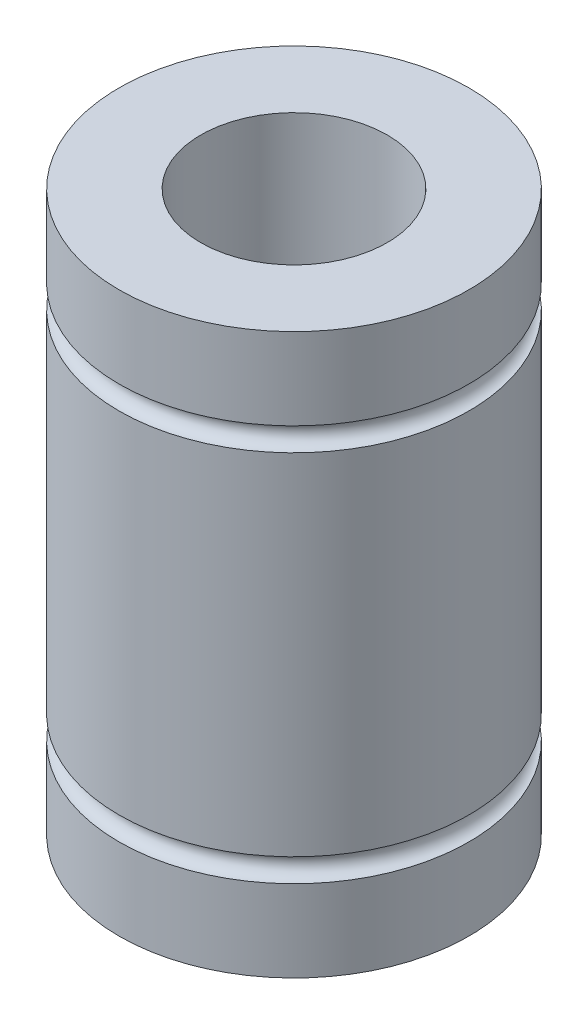
ISO-10303-21;
HEADER;
FILE_DESCRIPTION(('STEP AP214'),'2;1');
FILE_NAME('part.step','',(''),(''),'','','');
FILE_SCHEMA(('AUTOMOTIVE_DESIGN { 1 0 10303 214 1 1 1 1 }'));
ENDSEC;
DATA;
#1=APPLICATION_CONTEXT('core data for automotive mechanical design processes');
#2=APPLICATION_PROTOCOL_DEFINITION('international standard','automotive_design',2000,#1);
#3=PRODUCT_CONTEXT('',#1,'mechanical');
#4=PRODUCT('Part','Part','',(#3));
#5=PRODUCT_RELATED_PRODUCT_CATEGORY('part','',(#4));
#6=PRODUCT_DEFINITION_FORMATION('','',#4);
#7=PRODUCT_DEFINITION_CONTEXT('part definition',#1,'design');
#8=PRODUCT_DEFINITION('design','',#6,#7);
#9=PRODUCT_DEFINITION_SHAPE('','',#8);
#10=(LENGTH_UNIT() NAMED_UNIT(*) SI_UNIT(.MILLI.,.METRE.));
#11=(NAMED_UNIT(*) PLANE_ANGLE_UNIT() SI_UNIT($,.RADIAN.));
#12=(NAMED_UNIT(*) SI_UNIT($,.STERADIAN.) SOLID_ANGLE_UNIT());
#13=UNCERTAINTY_MEASURE_WITH_UNIT(LENGTH_MEASURE(1.E-05),#10,'distance_accuracy_value','');
#14=(GEOMETRIC_REPRESENTATION_CONTEXT(3) GLOBAL_UNCERTAINTY_ASSIGNED_CONTEXT((#13)) GLOBAL_UNIT_ASSIGNED_CONTEXT((#10,
#11,#12)) REPRESENTATION_CONTEXT('',''));
#15=CARTESIAN_POINT('',(0.,0.,0.));
#16=DIRECTION('',(0.,0.,1.));
#17=DIRECTION('',(1.,0.,0.));
#18=AXIS2_PLACEMENT_3D('',#15,#16,#17);
#19=CARTESIAN_POINT('',(0.,24.,0.));
#20=DIRECTION('',(0.,-1.,0.));
#21=DIRECTION('',(0.,0.,-1.));
#22=AXIS2_PLACEMENT_3D('',#19,#20,#21);
#23=CYLINDRICAL_SURFACE('',#22,7.5);
#24=CARTESIAN_POINT('',(0.,0.,0.));
#25=DIRECTION('',(0.,1.,0.));
#26=DIRECTION('',(0.,0.,1.));
#27=AXIS2_PLACEMENT_3D('',#24,#25,#26);
#28=CIRCLE('',#27,7.5);
#29=CARTESIAN_POINT('',(0.,0.,7.5));
#30=VERTEX_POINT('',#29);
#31=EDGE_CURVE('E39',#30,#30,#28,.T.);
#32=ORIENTED_EDGE('',*,*,#31,.T.);
#33=EDGE_LOOP('',(#32));
#34=FACE_BOUND('',#33,.T.);
#35=CARTESIAN_POINT('',(0.,3.5,0.));
#36=DIRECTION('',(0.,1.,0.));
#37=DIRECTION('',(0.,0.,1.));
#38=AXIS2_PLACEMENT_3D('',#35,#36,#37);
#39=CIRCLE('',#38,7.5);
#40=CARTESIAN_POINT('',(0.,3.5,7.5));
#41=VERTEX_POINT('',#40);
#42=EDGE_CURVE('E55',#41,#41,#39,.T.);
#43=ORIENTED_EDGE('',*,*,#42,.F.);
#44=EDGE_LOOP('',(#43));
#45=FACE_BOUND('',#44,.T.);
#46=ADVANCED_FACE('F31',(#34,#45),#23,.T.);
#47=CARTESIAN_POINT('',(0.,24.,0.));
#48=DIRECTION('',(0.,1.,0.));
#49=DIRECTION('',(0.,0.,1.));
#50=AXIS2_PLACEMENT_3D('',#47,#48,#49);
#51=CIRCLE('',#50,7.5);
#52=CARTESIAN_POINT('',(0.,24.,7.5));
#53=VERTEX_POINT('',#52);
#54=EDGE_CURVE('E10',#53,#53,#51,.T.);
#55=ORIENTED_EDGE('',*,*,#54,.F.);
#56=EDGE_LOOP('',(#55));
#57=FACE_BOUND('',#56,.T.);
#58=CARTESIAN_POINT('',(0.,20.5,0.));
#59=DIRECTION('',(0.,-1.,0.));
#60=DIRECTION('',(0.,0.,-1.));
#61=AXIS2_PLACEMENT_3D('',#58,#59,#60);
#62=CIRCLE('',#61,7.5);
#63=CARTESIAN_POINT('',(0.,20.5,-7.5));
#64=VERTEX_POINT('',#63);
#65=EDGE_CURVE('E53',#64,#64,#62,.T.);
#66=ORIENTED_EDGE('',*,*,#65,.F.);
#67=EDGE_LOOP('',(#66));
#68=FACE_BOUND('',#67,.T.);
#69=ADVANCED_FACE('F74',(#57,#68),#23,.T.);
#70=CARTESIAN_POINT('',(0.,24.,0.));
#71=DIRECTION('',(0.,1.,0.));
#72=DIRECTION('',(0.,0.,1.));
#73=AXIS2_PLACEMENT_3D('',#70,#71,#72);
#74=PLANE('',#73);
#75=ORIENTED_EDGE('',*,*,#54,.T.);
#76=EDGE_LOOP('',(#75));
#77=FACE_BOUND('',#76,.T.);
#78=CARTESIAN_POINT('',(0.,24.,0.));
#79=DIRECTION('',(0.,1.,0.));
#80=DIRECTION('',(0.,0.,1.));
#81=AXIS2_PLACEMENT_3D('',#78,#79,#80);
#82=CIRCLE('',#81,4.);
#83=CARTESIAN_POINT('',(0.,24.,4.));
#84=VERTEX_POINT('',#83);
#85=EDGE_CURVE('E44',#84,#84,#82,.T.);
#86=ORIENTED_EDGE('',*,*,#85,.F.);
#87=EDGE_LOOP('',(#86));
#88=FACE_BOUND('',#87,.T.);
#89=ADVANCED_FACE('F71',(#77,#88),#74,.T.);
#90=CARTESIAN_POINT('',(0.,0.,0.));
#91=DIRECTION('',(0.,1.,0.));
#92=DIRECTION('',(0.,0.,1.));
#93=AXIS2_PLACEMENT_3D('',#90,#91,#92);
#94=PLANE('',#93);
#95=ORIENTED_EDGE('',*,*,#31,.F.);
#96=EDGE_LOOP('',(#95));
#97=FACE_BOUND('',#96,.T.);
#98=CARTESIAN_POINT('',(0.,0.,0.));
#99=DIRECTION('',(0.,1.,0.));
#100=DIRECTION('',(0.,0.,1.));
#101=AXIS2_PLACEMENT_3D('',#98,#99,#100);
#102=CIRCLE('',#101,4.);
#103=CARTESIAN_POINT('',(0.,0.,4.));
#104=VERTEX_POINT('',#103);
#105=EDGE_CURVE('E47',#104,#104,#102,.T.);
#106=ORIENTED_EDGE('',*,*,#105,.T.);
#107=EDGE_LOOP('',(#106));
#108=FACE_BOUND('',#107,.T.);
#109=ADVANCED_FACE('F73',(#97,#108),#94,.F.);
#110=CARTESIAN_POINT('',(0.,24.,0.));
#111=DIRECTION('',(0.,-1.,0.));
#112=DIRECTION('',(0.,0.,-1.));
#113=AXIS2_PLACEMENT_3D('',#110,#111,#112);
#114=CYLINDRICAL_SURFACE('',#113,4.);
#115=ORIENTED_EDGE('',*,*,#85,.T.);
#116=EDGE_LOOP('',(#115));
#117=FACE_BOUND('',#116,.T.);
#118=ORIENTED_EDGE('',*,*,#105,.F.);
#119=EDGE_LOOP('',(#118));
#120=FACE_BOUND('',#119,.T.);
#121=ADVANCED_FACE('F68',(#117,#120),#114,.F.);
#122=CARTESIAN_POINT('',(0.,20.,0.));
#123=DIRECTION('',(0.,1.,0.));
#124=DIRECTION('',(0.,0.,1.));
#125=AXIS2_PLACEMENT_3D('',#122,#123,#124);
#126=TOROIDAL_SURFACE('',#125,7.5,0.500000000000001);
#127=CARTESIAN_POINT('',(0.,19.5,0.));
#128=DIRECTION('',(0.,1.,0.));
#129=DIRECTION('',(0.,0.,1.));
#130=AXIS2_PLACEMENT_3D('',#127,#128,#129);
#131=CIRCLE('',#130,7.5);
#132=CARTESIAN_POINT('',(0.,19.5,7.5));
#133=VERTEX_POINT('',#132);
#134=EDGE_CURVE('E50',#133,#133,#131,.T.);
#135=ORIENTED_EDGE('',*,*,#134,.T.);
#136=EDGE_LOOP('',(#135));
#137=FACE_BOUND('',#136,.T.);
#138=ORIENTED_EDGE('',*,*,#65,.T.);
#139=EDGE_LOOP('',(#138));
#140=FACE_BOUND('',#139,.T.);
#141=ADVANCED_FACE('F94',(#137,#140),#126,.F.);
#142=CARTESIAN_POINT('',(0.,4.,0.));
#143=DIRECTION('',(0.,1.,0.));
#144=DIRECTION('',(0.,0.,1.));
#145=AXIS2_PLACEMENT_3D('',#142,#143,#144);
#146=TOROIDAL_SURFACE('',#145,7.5,0.500000000000001);
#147=ORIENTED_EDGE('',*,*,#42,.T.);
#148=EDGE_LOOP('',(#147));
#149=FACE_BOUND('',#148,.T.);
#150=CARTESIAN_POINT('',(0.,4.5,0.));
#151=DIRECTION('',(0.,-1.,0.));
#152=DIRECTION('',(0.,0.,-1.));
#153=AXIS2_PLACEMENT_3D('',#150,#151,#152);
#154=CIRCLE('',#153,7.5);
#155=CARTESIAN_POINT('',(0.,4.5,-7.5));
#156=VERTEX_POINT('',#155);
#157=EDGE_CURVE('E35',#156,#156,#154,.T.);
#158=ORIENTED_EDGE('',*,*,#157,.T.);
#159=EDGE_LOOP('',(#158));
#160=FACE_BOUND('',#159,.T.);
#161=ADVANCED_FACE('F89',(#149,#160),#146,.F.);
#162=ORIENTED_EDGE('',*,*,#134,.F.);
#163=EDGE_LOOP('',(#162));
#164=FACE_BOUND('',#163,.T.);
#165=ORIENTED_EDGE('',*,*,#157,.F.);
#166=EDGE_LOOP('',(#165));
#167=FACE_BOUND('',#166,.T.);
#168=ADVANCED_FACE('F33',(#164,#167),#23,.T.);
#169=CLOSED_SHELL('',(#46,#69,#89,#109,#121,#141,#161,#168));
#170=MANIFOLD_SOLID_BREP('B2',#169);
#171=ADVANCED_BREP_SHAPE_REPRESENTATION('',(#18,#170),#14);
#172=SHAPE_DEFINITION_REPRESENTATION(#9,#171);
ENDSEC;
END-ISO-10303-21;
